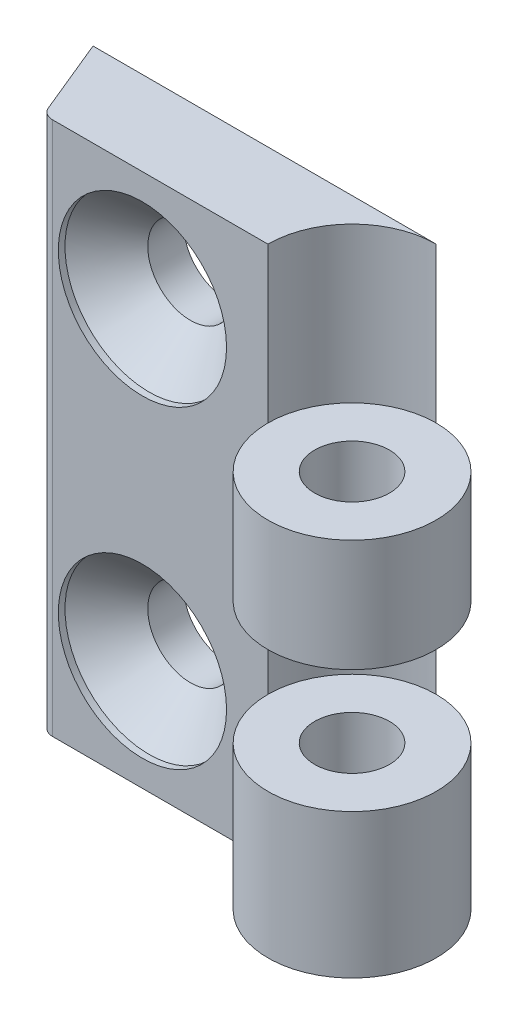
ISO-10303-21;
HEADER;
FILE_DESCRIPTION(('STEP AP214'),'2;1');
FILE_NAME('part.step','',(''),(''),'','','');
FILE_SCHEMA(('AUTOMOTIVE_DESIGN { 1 0 10303 214 1 1 1 1 }'));
ENDSEC;
DATA;
#1=APPLICATION_CONTEXT('core data for automotive mechanical design processes');
#2=APPLICATION_PROTOCOL_DEFINITION('international standard','automotive_design',2000,#1);
#3=PRODUCT_CONTEXT('',#1,'mechanical');
#4=PRODUCT('Part','Part','',(#3));
#5=PRODUCT_RELATED_PRODUCT_CATEGORY('part','',(#4));
#6=PRODUCT_DEFINITION_FORMATION('','',#4);
#7=PRODUCT_DEFINITION_CONTEXT('part definition',#1,'design');
#8=PRODUCT_DEFINITION('design','',#6,#7);
#9=PRODUCT_DEFINITION_SHAPE('','',#8);
#10=(LENGTH_UNIT() NAMED_UNIT(*) SI_UNIT(.MILLI.,.METRE.));
#11=(NAMED_UNIT(*) PLANE_ANGLE_UNIT() SI_UNIT($,.RADIAN.));
#12=(NAMED_UNIT(*) SI_UNIT($,.STERADIAN.) SOLID_ANGLE_UNIT());
#13=UNCERTAINTY_MEASURE_WITH_UNIT(LENGTH_MEASURE(1.E-05),#10,'distance_accuracy_value','');
#14=(GEOMETRIC_REPRESENTATION_CONTEXT(3) GLOBAL_UNCERTAINTY_ASSIGNED_CONTEXT((#13)) GLOBAL_UNIT_ASSIGNED_CONTEXT((#10,
#11,#12)) REPRESENTATION_CONTEXT('',''));
#15=CARTESIAN_POINT('',(0.,0.,0.));
#16=DIRECTION('',(0.,0.,1.));
#17=DIRECTION('',(1.,0.,0.));
#18=AXIS2_PLACEMENT_3D('',#15,#16,#17);
#19=CARTESIAN_POINT('',(0.,40.,0.));
#20=DIRECTION('',(0.,-1.,0.));
#21=DIRECTION('',(0.,0.,-1.));
#22=AXIS2_PLACEMENT_3D('',#19,#20,#21);
#23=CYLINDRICAL_SURFACE('',#22,6.3);
#24=DIRECTION('',(0.,-1.,0.));
#25=VECTOR('',#24,1.);
#26=CARTESIAN_POINT('',(0.,40.,-6.3));
#27=LINE('',#26,#25);
#28=CARTESIAN_POINT('',(0.,20.,-6.3));
#29=VERTEX_POINT('',#28);
#30=CARTESIAN_POINT('',(0.,10.8,-6.3));
#31=VERTEX_POINT('',#30);
#32=EDGE_CURVE('E57',#29,#31,#27,.T.);
#33=ORIENTED_EDGE('',*,*,#32,.F.);
#34=CARTESIAN_POINT('',(0.,20.,0.));
#35=DIRECTION('',(0.,1.,0.));
#36=DIRECTION('',(0.,0.,1.));
#37=AXIS2_PLACEMENT_3D('',#34,#35,#36);
#38=CIRCLE('',#37,6.3);
#39=CARTESIAN_POINT('',(-6.3,20.,0.));
#40=VERTEX_POINT('',#39);
#41=EDGE_CURVE('E42',#29,#40,#38,.T.);
#42=ORIENTED_EDGE('',*,*,#41,.T.);
#43=DIRECTION('',(0.,-1.,0.));
#44=VECTOR('',#43,1.);
#45=CARTESIAN_POINT('',(-6.3,40.,0.));
#46=LINE('',#45,#44);
#47=CARTESIAN_POINT('',(-6.3,10.8,0.));
#48=VERTEX_POINT('',#47);
#49=EDGE_CURVE('E129',#40,#48,#46,.T.);
#50=ORIENTED_EDGE('',*,*,#49,.T.);
#51=CARTESIAN_POINT('',(0.,10.8,0.));
#52=DIRECTION('',(0.,1.,0.));
#53=DIRECTION('',(0.,0.,1.));
#54=AXIS2_PLACEMENT_3D('',#51,#52,#53);
#55=CIRCLE('',#54,6.3);
#56=EDGE_CURVE('E149',#48,#31,#55,.F.);
#57=ORIENTED_EDGE('',*,*,#56,.T.);
#58=EDGE_LOOP('',(#33,#42,#50,#57));
#59=FACE_BOUND('',#58,.T.);
#60=ADVANCED_FACE('F34',(#59),#23,.F.);
#61=CARTESIAN_POINT('',(0.,10.8,0.));
#62=DIRECTION('',(0.,0.,-1.));
#63=DIRECTION('',(-1.,0.,0.));
#64=AXIS2_PLACEMENT_3D('',#61,#62,#63);
#65=PLANE('',#64);
#66=CARTESIAN_POINT('',(-15.7,31.75,0.));
#67=DIRECTION('',(0.,0.,1.));
#68=DIRECTION('',(1.,0.,0.));
#69=AXIS2_PLACEMENT_3D('',#66,#67,#68);
#70=CIRCLE('',#69,6.3);
#71=CARTESIAN_POINT('',(-9.40000000000001,31.75,0.));
#72=VERTEX_POINT('',#71);
#73=EDGE_CURVE('E208',#72,#72,#70,.T.);
#74=ORIENTED_EDGE('',*,*,#73,.F.);
#75=EDGE_LOOP('',(#74));
#76=FACE_BOUND('',#75,.T.);
#77=CARTESIAN_POINT('',(-15.7,8.24999999999999,0.));
#78=DIRECTION('',(0.,0.,1.));
#79=DIRECTION('',(1.,0.,0.));
#80=AXIS2_PLACEMENT_3D('',#77,#78,#79);
#81=CIRCLE('',#80,6.3);
#82=CARTESIAN_POINT('',(-9.40000000000001,8.24999999999999,0.));
#83=VERTEX_POINT('',#82);
#84=EDGE_CURVE('E196',#83,#83,#81,.T.);
#85=ORIENTED_EDGE('',*,*,#84,.F.);
#86=EDGE_LOOP('',(#85));
#87=FACE_BOUND('',#86,.T.);
#88=DIRECTION('',(0.,-1.,0.));
#89=VECTOR('',#88,1.);
#90=CARTESIAN_POINT('',(-22.4338096210309,10.8,0.));
#91=LINE('',#90,#89);
#92=CARTESIAN_POINT('',(-22.4338096210309,40.,0.));
#93=VERTEX_POINT('',#92);
#94=CARTESIAN_POINT('',(-22.4338096210309,0.,0.));
#95=VERTEX_POINT('',#94);
#96=EDGE_CURVE('E93',#93,#95,#91,.T.);
#97=ORIENTED_EDGE('',*,*,#96,.T.);
#98=DIRECTION('',(1.,0.,0.));
#99=VECTOR('',#98,1.);
#100=CARTESIAN_POINT('',(0.,0.,0.));
#101=LINE('',#100,#99);
#102=CARTESIAN_POINT('',(-6.3,0.,0.));
#103=VERTEX_POINT('',#102);
#104=EDGE_CURVE('E102',#95,#103,#101,.T.);
#105=ORIENTED_EDGE('',*,*,#104,.T.);
#106=DIRECTION('',(0.,-1.,0.));
#107=VECTOR('',#106,1.);
#108=CARTESIAN_POINT('',(-6.3,10.8,0.));
#109=LINE('',#108,#107);
#110=EDGE_CURVE('E122',#48,#103,#109,.T.);
#111=ORIENTED_EDGE('',*,*,#110,.F.);
#112=ORIENTED_EDGE('',*,*,#49,.F.);
#113=DIRECTION('',(0.,-1.,0.));
#114=VECTOR('',#113,1.);
#115=CARTESIAN_POINT('',(-6.3,28.4,0.));
#116=LINE('',#115,#114);
#117=CARTESIAN_POINT('',(-6.3,28.4,0.));
#118=VERTEX_POINT('',#117);
#119=EDGE_CURVE('E136',#118,#40,#116,.T.);
#120=ORIENTED_EDGE('',*,*,#119,.F.);
#121=CARTESIAN_POINT('',(-6.3,40.,0.));
#122=VERTEX_POINT('',#121);
#123=EDGE_CURVE('E139',#122,#118,#46,.T.);
#124=ORIENTED_EDGE('',*,*,#123,.F.);
#125=DIRECTION('',(1.,0.,0.));
#126=VECTOR('',#125,1.);
#127=CARTESIAN_POINT('',(0.,40.,0.));
#128=LINE('',#127,#126);
#129=EDGE_CURVE('E140',#93,#122,#128,.T.);
#130=ORIENTED_EDGE('',*,*,#129,.F.);
#131=EDGE_LOOP('',(#97,#105,#111,#112,#120,#124,#130));
#132=FACE_BOUND('',#131,.T.);
#133=ADVANCED_FACE('F36',(#76,#87,#132),#65,.F.);
#134=CARTESIAN_POINT('',(0.,10.8,0.));
#135=DIRECTION('',(0.,-1.,0.));
#136=DIRECTION('',(0.,0.,-1.));
#137=AXIS2_PLACEMENT_3D('',#134,#135,#136);
#138=CYLINDRICAL_SURFACE('',#137,6.3);
#139=CARTESIAN_POINT('',(0.,0.,0.));
#140=DIRECTION('',(0.,1.,0.));
#141=DIRECTION('',(0.,0.,1.));
#142=AXIS2_PLACEMENT_3D('',#139,#140,#141);
#143=CIRCLE('',#142,6.3);
#144=CARTESIAN_POINT('',(0.,0.,-6.3));
#145=VERTEX_POINT('',#144);
#146=EDGE_CURVE('E110',#103,#145,#143,.T.);
#147=ORIENTED_EDGE('',*,*,#146,.T.);
#148=DIRECTION('',(0.,-1.,0.));
#149=VECTOR('',#148,1.);
#150=CARTESIAN_POINT('',(0.,10.8,-6.3));
#151=LINE('',#150,#149);
#152=EDGE_CURVE('E120',#31,#145,#151,.T.);
#153=ORIENTED_EDGE('',*,*,#152,.F.);
#154=CARTESIAN_POINT('',(0.,10.8,0.));
#155=DIRECTION('',(0.,1.,0.));
#156=DIRECTION('',(0.,0.,1.));
#157=AXIS2_PLACEMENT_3D('',#154,#155,#156);
#158=CIRCLE('',#157,6.3);
#159=EDGE_CURVE('E116',#48,#31,#158,.T.);
#160=ORIENTED_EDGE('',*,*,#159,.F.);
#161=ORIENTED_EDGE('',*,*,#110,.T.);
#162=EDGE_LOOP('',(#147,#153,#160,#161));
#163=FACE_BOUND('',#162,.T.);
#164=ADVANCED_FACE('F156',(#163),#138,.T.);
#165=CARTESIAN_POINT('',(0.,10.8,-6.3));
#166=DIRECTION('',(0.,0.,1.));
#167=DIRECTION('',(1.,0.,0.));
#168=AXIS2_PLACEMENT_3D('',#165,#166,#167);
#169=PLANE('',#168);
#170=CARTESIAN_POINT('',(-15.7,31.75,-6.3));
#171=DIRECTION('',(0.,0.,1.));
#172=DIRECTION('',(1.,0.,0.));
#173=AXIS2_PLACEMENT_3D('',#170,#171,#172);
#174=CIRCLE('',#173,3.2);
#175=CARTESIAN_POINT('',(-12.5,31.75,-6.3));
#176=VERTEX_POINT('',#175);
#177=EDGE_CURVE('E199',#176,#176,#174,.T.);
#178=ORIENTED_EDGE('',*,*,#177,.T.);
#179=EDGE_LOOP('',(#178));
#180=FACE_BOUND('',#179,.T.);
#181=CARTESIAN_POINT('',(-15.7,8.24999999999999,-6.3));
#182=DIRECTION('',(0.,0.,1.));
#183=DIRECTION('',(1.,0.,0.));
#184=AXIS2_PLACEMENT_3D('',#181,#182,#183);
#185=CIRCLE('',#184,3.2);
#186=CARTESIAN_POINT('',(-12.5,8.24999999999999,-6.3));
#187=VERTEX_POINT('',#186);
#188=EDGE_CURVE('E183',#187,#187,#185,.T.);
#189=ORIENTED_EDGE('',*,*,#188,.T.);
#190=EDGE_LOOP('',(#189));
#191=FACE_BOUND('',#190,.T.);
#192=CARTESIAN_POINT('',(0.,40.,-6.3));
#193=VERTEX_POINT('',#192);
#194=CARTESIAN_POINT('',(0.,28.4,-6.3));
#195=VERTEX_POINT('',#194);
#196=EDGE_CURVE('E146',#193,#195,#27,.T.);
#197=ORIENTED_EDGE('',*,*,#196,.T.);
#198=DIRECTION('',(0.,-1.,0.));
#199=VECTOR('',#198,1.);
#200=CARTESIAN_POINT('',(0.,28.4,-6.3));
#201=LINE('',#200,#199);
#202=EDGE_CURVE('E174',#195,#29,#201,.T.);
#203=ORIENTED_EDGE('',*,*,#202,.T.);
#204=ORIENTED_EDGE('',*,*,#32,.T.);
#205=ORIENTED_EDGE('',*,*,#152,.T.);
#206=DIRECTION('',(-1.,0.,0.));
#207=VECTOR('',#206,1.);
#208=CARTESIAN_POINT('',(0.,0.,-6.3));
#209=LINE('',#208,#207);
#210=CARTESIAN_POINT('',(-25.7,0.,-6.3));
#211=VERTEX_POINT('',#210);
#212=EDGE_CURVE('E108',#145,#211,#209,.T.);
#213=ORIENTED_EDGE('',*,*,#212,.T.);
#214=DIRECTION('',(0.,-1.,0.));
#215=VECTOR('',#214,1.);
#216=CARTESIAN_POINT('',(-25.7,10.8,-6.3));
#217=LINE('',#216,#215);
#218=CARTESIAN_POINT('',(-25.7,40.,-6.3));
#219=VERTEX_POINT('',#218);
#220=EDGE_CURVE('E92',#219,#211,#217,.T.);
#221=ORIENTED_EDGE('',*,*,#220,.F.);
#222=DIRECTION('',(-1.,0.,0.));
#223=VECTOR('',#222,1.);
#224=CARTESIAN_POINT('',(0.,40.,-6.3));
#225=LINE('',#224,#223);
#226=EDGE_CURVE('E162',#193,#219,#225,.T.);
#227=ORIENTED_EDGE('',*,*,#226,.F.);
#228=EDGE_LOOP('',(#197,#203,#204,#205,#213,#221,#227));
#229=FACE_BOUND('',#228,.T.);
#230=ADVANCED_FACE('F157',(#180,#191,#229),#169,.F.);
#231=CARTESIAN_POINT('',(-19.7481276382867,10.8,8.13985540589008));
#232=DIRECTION('',(-0.92454166980743,0.,0.381080963562455));
#233=DIRECTION('',(0.381080963562455,0.,0.92454166980743));
#234=AXIS2_PLACEMENT_3D('',#231,#232,#233);
#235=PLANE('',#234);
#236=ORIENTED_EDGE('',*,*,#220,.T.);
#237=DIRECTION('',(-0.381080963562455,0.,-0.92454166980743));
#238=VECTOR('',#237,1.);
#239=CARTESIAN_POINT('',(-19.7481276382867,0.,8.13985540589008));
#240=LINE('',#239,#238);
#241=CARTESIAN_POINT('',(-23.3583512908384,0.,-0.61891903643754));
#242=VERTEX_POINT('',#241);
#243=EDGE_CURVE('E100',#242,#211,#240,.T.);
#244=ORIENTED_EDGE('',*,*,#243,.F.);
#245=DIRECTION('',(0.,-1.,0.));
#246=VECTOR('',#245,1.);
#247=CARTESIAN_POINT('',(-23.3583512908384,10.8,-0.61891903643754));
#248=LINE('',#247,#246);
#249=CARTESIAN_POINT('',(-23.3583512908384,40.,-0.61891903643754));
#250=VERTEX_POINT('',#249);
#251=EDGE_CURVE('E79',#250,#242,#248,.T.);
#252=ORIENTED_EDGE('',*,*,#251,.F.);
#253=DIRECTION('',(-0.381080963562455,0.,-0.92454166980743));
#254=VECTOR('',#253,1.);
#255=CARTESIAN_POINT('',(-19.7481276382867,40.,8.13985540589008));
#256=LINE('',#255,#254);
#257=EDGE_CURVE('E167',#250,#219,#256,.T.);
#258=ORIENTED_EDGE('',*,*,#257,.T.);
#259=EDGE_LOOP('',(#236,#244,#252,#258));
#260=FACE_BOUND('',#259,.T.);
#261=ADVANCED_FACE('F105',(#260),#235,.T.);
#262=CARTESIAN_POINT('',(-22.4338096210309,10.8,-0.999999999999997));
#263=DIRECTION('',(0.,-1.,0.));
#264=DIRECTION('',(0.,0.,-1.));
#265=AXIS2_PLACEMENT_3D('',#262,#263,#264);
#266=CYLINDRICAL_SURFACE('',#265,1.);
#267=ORIENTED_EDGE('',*,*,#251,.T.);
#268=CARTESIAN_POINT('',(-22.4338096210309,0.,-0.999999999999997));
#269=DIRECTION('',(0.,1.,0.));
#270=DIRECTION('',(0.,0.,1.));
#271=AXIS2_PLACEMENT_3D('',#268,#269,#270);
#272=CIRCLE('',#271,1.);
#273=EDGE_CURVE('E83',#242,#95,#272,.T.);
#274=ORIENTED_EDGE('',*,*,#273,.T.);
#275=ORIENTED_EDGE('',*,*,#96,.F.);
#276=CARTESIAN_POINT('',(-22.4338096210309,40.,-0.999999999999997));
#277=DIRECTION('',(0.,1.,0.));
#278=DIRECTION('',(0.,0.,1.));
#279=AXIS2_PLACEMENT_3D('',#276,#277,#278);
#280=CIRCLE('',#279,1.);
#281=EDGE_CURVE('E87',#250,#93,#280,.T.);
#282=ORIENTED_EDGE('',*,*,#281,.F.);
#283=EDGE_LOOP('',(#267,#274,#275,#282));
#284=FACE_BOUND('',#283,.T.);
#285=ADVANCED_FACE('F81',(#284),#266,.T.);
#286=CARTESIAN_POINT('',(0.,10.8,0.));
#287=DIRECTION('',(0.,-1.,0.));
#288=DIRECTION('',(0.,0.,-1.));
#289=AXIS2_PLACEMENT_3D('',#286,#287,#288);
#290=CYLINDRICAL_SURFACE('',#289,2.8);
#291=CARTESIAN_POINT('',(0.,10.8,0.));
#292=DIRECTION('',(0.,1.,0.));
#293=DIRECTION('',(0.,0.,1.));
#294=AXIS2_PLACEMENT_3D('',#291,#292,#293);
#295=CIRCLE('',#294,2.8);
#296=CARTESIAN_POINT('',(0.,10.8,2.8));
#297=VERTEX_POINT('',#296);
#298=EDGE_CURVE('E117',#297,#297,#295,.T.);
#299=ORIENTED_EDGE('',*,*,#298,.T.);
#300=EDGE_LOOP('',(#299));
#301=FACE_BOUND('',#300,.T.);
#302=CARTESIAN_POINT('',(0.,0.,0.));
#303=DIRECTION('',(0.,1.,0.));
#304=DIRECTION('',(0.,0.,1.));
#305=AXIS2_PLACEMENT_3D('',#302,#303,#304);
#306=CIRCLE('',#305,2.8);
#307=CARTESIAN_POINT('',(0.,0.,2.8));
#308=VERTEX_POINT('',#307);
#309=EDGE_CURVE('E103',#308,#308,#306,.T.);
#310=ORIENTED_EDGE('',*,*,#309,.F.);
#311=EDGE_LOOP('',(#310));
#312=FACE_BOUND('',#311,.T.);
#313=ADVANCED_FACE('F386',(#301,#312),#290,.F.);
#314=CARTESIAN_POINT('',(0.,10.8,0.));
#315=DIRECTION('',(0.,1.,0.));
#316=DIRECTION('',(0.,0.,1.));
#317=AXIS2_PLACEMENT_3D('',#314,#315,#316);
#318=PLANE('',#317);
#319=ORIENTED_EDGE('',*,*,#56,.F.);
#320=ORIENTED_EDGE('',*,*,#159,.T.);
#321=EDGE_LOOP('',(#319,#320));
#322=FACE_BOUND('',#321,.T.);
#323=ORIENTED_EDGE('',*,*,#298,.F.);
#324=EDGE_LOOP('',(#323));
#325=FACE_BOUND('',#324,.T.);
#326=ADVANCED_FACE('F249',(#322,#325),#318,.T.);
#327=CARTESIAN_POINT('',(0.,0.,0.));
#328=DIRECTION('',(0.,1.,0.));
#329=DIRECTION('',(0.,0.,1.));
#330=AXIS2_PLACEMENT_3D('',#327,#328,#329);
#331=PLANE('',#330);
#332=ORIENTED_EDGE('',*,*,#146,.F.);
#333=ORIENTED_EDGE('',*,*,#104,.F.);
#334=ORIENTED_EDGE('',*,*,#273,.F.);
#335=ORIENTED_EDGE('',*,*,#243,.T.);
#336=ORIENTED_EDGE('',*,*,#212,.F.);
#337=EDGE_LOOP('',(#332,#333,#334,#335,#336));
#338=FACE_BOUND('',#337,.T.);
#339=ORIENTED_EDGE('',*,*,#309,.T.);
#340=EDGE_LOOP('',(#339));
#341=FACE_BOUND('',#340,.T.);
#342=ADVANCED_FACE('F97',(#338,#341),#331,.F.);
#343=CARTESIAN_POINT('',(0.,28.4,0.));
#344=DIRECTION('',(0.,1.,0.));
#345=DIRECTION('',(0.,0.,1.));
#346=AXIS2_PLACEMENT_3D('',#343,#344,#345);
#347=CIRCLE('',#346,6.3);
#348=EDGE_CURVE('E11',#195,#118,#347,.T.);
#349=ORIENTED_EDGE('',*,*,#348,.F.);
#350=ORIENTED_EDGE('',*,*,#196,.F.);
#351=CARTESIAN_POINT('',(0.,40.,0.));
#352=DIRECTION('',(0.,1.,0.));
#353=DIRECTION('',(0.,0.,1.));
#354=AXIS2_PLACEMENT_3D('',#351,#352,#353);
#355=CIRCLE('',#354,6.3);
#356=EDGE_CURVE('E169',#193,#122,#355,.T.);
#357=ORIENTED_EDGE('',*,*,#356,.T.);
#358=ORIENTED_EDGE('',*,*,#123,.T.);
#359=EDGE_LOOP('',(#349,#350,#357,#358));
#360=FACE_BOUND('',#359,.T.);
#361=ADVANCED_FACE('F237',(#360),#23,.F.);
#362=CARTESIAN_POINT('',(0.,40.,0.));
#363=DIRECTION('',(0.,1.,0.));
#364=DIRECTION('',(0.,0.,1.));
#365=AXIS2_PLACEMENT_3D('',#362,#363,#364);
#366=PLANE('',#365);
#367=ORIENTED_EDGE('',*,*,#356,.F.);
#368=ORIENTED_EDGE('',*,*,#226,.T.);
#369=ORIENTED_EDGE('',*,*,#257,.F.);
#370=ORIENTED_EDGE('',*,*,#281,.T.);
#371=ORIENTED_EDGE('',*,*,#129,.T.);
#372=EDGE_LOOP('',(#367,#368,#369,#370,#371));
#373=FACE_BOUND('',#372,.T.);
#374=ADVANCED_FACE('F166',(#373),#366,.T.);
#375=CARTESIAN_POINT('',(0.,28.4,0.));
#376=DIRECTION('',(0.,-1.,0.));
#377=DIRECTION('',(0.,0.,-1.));
#378=AXIS2_PLACEMENT_3D('',#375,#376,#377);
#379=CYLINDRICAL_SURFACE('',#378,6.3);
#380=CARTESIAN_POINT('',(0.,20.,0.));
#381=DIRECTION('',(0.,1.,0.));
#382=DIRECTION('',(0.,0.,1.));
#383=AXIS2_PLACEMENT_3D('',#380,#381,#382);
#384=CIRCLE('',#383,6.3);
#385=EDGE_CURVE('E48',#40,#29,#384,.T.);
#386=ORIENTED_EDGE('',*,*,#385,.T.);
#387=ORIENTED_EDGE('',*,*,#202,.F.);
#388=CARTESIAN_POINT('',(0.,28.4,0.));
#389=DIRECTION('',(0.,1.,0.));
#390=DIRECTION('',(0.,0.,1.));
#391=AXIS2_PLACEMENT_3D('',#388,#389,#390);
#392=CIRCLE('',#391,6.3);
#393=EDGE_CURVE('E177',#118,#195,#392,.T.);
#394=ORIENTED_EDGE('',*,*,#393,.F.);
#395=ORIENTED_EDGE('',*,*,#119,.T.);
#396=EDGE_LOOP('',(#386,#387,#394,#395));
#397=FACE_BOUND('',#396,.T.);
#398=ADVANCED_FACE('F248',(#397),#379,.T.);
#399=CARTESIAN_POINT('',(0.,28.4,0.));
#400=DIRECTION('',(0.,-1.,0.));
#401=DIRECTION('',(0.,0.,-1.));
#402=AXIS2_PLACEMENT_3D('',#399,#400,#401);
#403=CYLINDRICAL_SURFACE('',#402,2.8);
#404=CARTESIAN_POINT('',(0.,28.4,0.));
#405=DIRECTION('',(0.,1.,0.));
#406=DIRECTION('',(0.,0.,1.));
#407=AXIS2_PLACEMENT_3D('',#404,#405,#406);
#408=CIRCLE('',#407,2.8);
#409=CARTESIAN_POINT('',(0.,28.4,2.8));
#410=VERTEX_POINT('',#409);
#411=EDGE_CURVE('E179',#410,#410,#408,.T.);
#412=ORIENTED_EDGE('',*,*,#411,.T.);
#413=EDGE_LOOP('',(#412));
#414=FACE_BOUND('',#413,.T.);
#415=CARTESIAN_POINT('',(0.,20.,0.));
#416=DIRECTION('',(0.,1.,0.));
#417=DIRECTION('',(0.,0.,1.));
#418=AXIS2_PLACEMENT_3D('',#415,#416,#417);
#419=CIRCLE('',#418,2.8);
#420=CARTESIAN_POINT('',(0.,20.,2.8));
#421=VERTEX_POINT('',#420);
#422=EDGE_CURVE('E180',#421,#421,#419,.T.);
#423=ORIENTED_EDGE('',*,*,#422,.F.);
#424=EDGE_LOOP('',(#423));
#425=FACE_BOUND('',#424,.T.);
#426=ADVANCED_FACE('F264',(#414,#425),#403,.F.);
#427=CARTESIAN_POINT('',(0.,28.4,0.));
#428=DIRECTION('',(0.,1.,0.));
#429=DIRECTION('',(0.,0.,1.));
#430=AXIS2_PLACEMENT_3D('',#427,#428,#429);
#431=PLANE('',#430);
#432=ORIENTED_EDGE('',*,*,#411,.F.);
#433=EDGE_LOOP('',(#432));
#434=FACE_BOUND('',#433,.T.);
#435=ORIENTED_EDGE('',*,*,#393,.T.);
#436=ORIENTED_EDGE('',*,*,#348,.T.);
#437=EDGE_LOOP('',(#435,#436));
#438=FACE_BOUND('',#437,.T.);
#439=ADVANCED_FACE('F261',(#434,#438),#431,.T.);
#440=CARTESIAN_POINT('',(0.,20.,0.));
#441=DIRECTION('',(0.,1.,0.));
#442=DIRECTION('',(0.,0.,1.));
#443=AXIS2_PLACEMENT_3D('',#440,#441,#442);
#444=PLANE('',#443);
#445=ORIENTED_EDGE('',*,*,#41,.F.);
#446=ORIENTED_EDGE('',*,*,#385,.F.);
#447=EDGE_LOOP('',(#445,#446));
#448=FACE_BOUND('',#447,.T.);
#449=ORIENTED_EDGE('',*,*,#422,.T.);
#450=EDGE_LOOP('',(#449));
#451=FACE_BOUND('',#450,.T.);
#452=ADVANCED_FACE('F263',(#448,#451),#444,.F.);
#453=CARTESIAN_POINT('',(-15.7,8.24999999999999,0.));
#454=DIRECTION('',(0.,0.,1.));
#455=DIRECTION('',(1.,0.,0.));
#456=AXIS2_PLACEMENT_3D('',#453,#454,#455);
#457=CYLINDRICAL_SURFACE('',#456,3.2);
#458=ORIENTED_EDGE('',*,*,#188,.F.);
#459=EDGE_LOOP('',(#458));
#460=FACE_BOUND('',#459,.T.);
#461=CARTESIAN_POINT('',(-15.7,8.24999999999999,-3.6));
#462=DIRECTION('',(0.,0.,1.));
#463=DIRECTION('',(1.,0.,0.));
#464=AXIS2_PLACEMENT_3D('',#461,#462,#463);
#465=CIRCLE('',#464,3.2);
#466=CARTESIAN_POINT('',(-12.5,8.24999999999999,-3.6));
#467=VERTEX_POINT('',#466);
#468=EDGE_CURVE('E190',#467,#467,#465,.T.);
#469=ORIENTED_EDGE('',*,*,#468,.T.);
#470=EDGE_LOOP('',(#469));
#471=FACE_BOUND('',#470,.T.);
#472=ADVANCED_FACE('F231',(#460,#471),#457,.F.);
#473=CARTESIAN_POINT('',(-15.7,8.24999999999999,-0.5));
#474=DIRECTION('',(0.,0.,1.));
#475=DIRECTION('',(1.,0.,0.));
#476=AXIS2_PLACEMENT_3D('',#473,#474,#475);
#477=CONICAL_SURFACE('',#476,6.3,0.785398163397448);
#478=ORIENTED_EDGE('',*,*,#468,.F.);
#479=EDGE_LOOP('',(#478));
#480=FACE_BOUND('',#479,.T.);
#481=CARTESIAN_POINT('',(-15.7,8.24999999999999,-0.5));
#482=DIRECTION('',(0.,0.,1.));
#483=DIRECTION('',(1.,0.,0.));
#484=AXIS2_PLACEMENT_3D('',#481,#482,#483);
#485=CIRCLE('',#484,6.3);
#486=CARTESIAN_POINT('',(-9.40000000000001,8.24999999999999,-0.5));
#487=VERTEX_POINT('',#486);
#488=EDGE_CURVE('E193',#487,#487,#485,.T.);
#489=ORIENTED_EDGE('',*,*,#488,.T.);
#490=EDGE_LOOP('',(#489));
#491=FACE_BOUND('',#490,.T.);
#492=ADVANCED_FACE('F221',(#480,#491),#477,.F.);
#493=CARTESIAN_POINT('',(-15.7,8.24999999999999,0.));
#494=DIRECTION('',(0.,0.,1.));
#495=DIRECTION('',(1.,0.,0.));
#496=AXIS2_PLACEMENT_3D('',#493,#494,#495);
#497=CYLINDRICAL_SURFACE('',#496,6.3);
#498=ORIENTED_EDGE('',*,*,#488,.F.);
#499=EDGE_LOOP('',(#498));
#500=FACE_BOUND('',#499,.T.);
#501=ORIENTED_EDGE('',*,*,#84,.T.);
#502=EDGE_LOOP('',(#501));
#503=FACE_BOUND('',#502,.T.);
#504=ADVANCED_FACE('F218',(#500,#503),#497,.F.);
#505=CARTESIAN_POINT('',(-15.7,31.75,0.));
#506=DIRECTION('',(0.,0.,1.));
#507=DIRECTION('',(1.,0.,0.));
#508=AXIS2_PLACEMENT_3D('',#505,#506,#507);
#509=CYLINDRICAL_SURFACE('',#508,3.2);
#510=ORIENTED_EDGE('',*,*,#177,.F.);
#511=EDGE_LOOP('',(#510));
#512=FACE_BOUND('',#511,.T.);
#513=CARTESIAN_POINT('',(-15.7,31.75,-3.6));
#514=DIRECTION('',(0.,0.,1.));
#515=DIRECTION('',(1.,0.,0.));
#516=AXIS2_PLACEMENT_3D('',#513,#514,#515);
#517=CIRCLE('',#516,3.2);
#518=CARTESIAN_POINT('',(-12.5,31.75,-3.6));
#519=VERTEX_POINT('',#518);
#520=EDGE_CURVE('E202',#519,#519,#517,.T.);
#521=ORIENTED_EDGE('',*,*,#520,.T.);
#522=EDGE_LOOP('',(#521));
#523=FACE_BOUND('',#522,.T.);
#524=ADVANCED_FACE('F220',(#512,#523),#509,.F.);
#525=CARTESIAN_POINT('',(-15.7,31.75,-0.5));
#526=DIRECTION('',(0.,0.,1.));
#527=DIRECTION('',(1.,0.,0.));
#528=AXIS2_PLACEMENT_3D('',#525,#526,#527);
#529=CONICAL_SURFACE('',#528,6.3,0.785398163397448);
#530=ORIENTED_EDGE('',*,*,#520,.F.);
#531=EDGE_LOOP('',(#530));
#532=FACE_BOUND('',#531,.T.);
#533=CARTESIAN_POINT('',(-15.7,31.75,-0.5));
#534=DIRECTION('',(0.,0.,1.));
#535=DIRECTION('',(1.,0.,0.));
#536=AXIS2_PLACEMENT_3D('',#533,#534,#535);
#537=CIRCLE('',#536,6.3);
#538=CARTESIAN_POINT('',(-9.40000000000001,31.75,-0.5));
#539=VERTEX_POINT('',#538);
#540=EDGE_CURVE('E205',#539,#539,#537,.T.);
#541=ORIENTED_EDGE('',*,*,#540,.T.);
#542=EDGE_LOOP('',(#541));
#543=FACE_BOUND('',#542,.T.);
#544=ADVANCED_FACE('F228',(#532,#543),#529,.F.);
#545=CARTESIAN_POINT('',(-15.7,31.75,0.));
#546=DIRECTION('',(0.,0.,1.));
#547=DIRECTION('',(1.,0.,0.));
#548=AXIS2_PLACEMENT_3D('',#545,#546,#547);
#549=CYLINDRICAL_SURFACE('',#548,6.3);
#550=ORIENTED_EDGE('',*,*,#540,.F.);
#551=EDGE_LOOP('',(#550));
#552=FACE_BOUND('',#551,.T.);
#553=ORIENTED_EDGE('',*,*,#73,.T.);
#554=EDGE_LOOP('',(#553));
#555=FACE_BOUND('',#554,.T.);
#556=ADVANCED_FACE('F212',(#552,#555),#549,.F.);
#557=CLOSED_SHELL('',(#60,#133,#164,#230,#261,#285,#313,#326,#342,#361,#374,#398,#426,#439,#452,
#472,#492,#504,#524,#544,#556));
#558=MANIFOLD_SOLID_BREP('B2',#557);
#559=ADVANCED_BREP_SHAPE_REPRESENTATION('',(#18,#558),#14);
#560=SHAPE_DEFINITION_REPRESENTATION(#9,#559);
ENDSEC;
END-ISO-10303-21;
